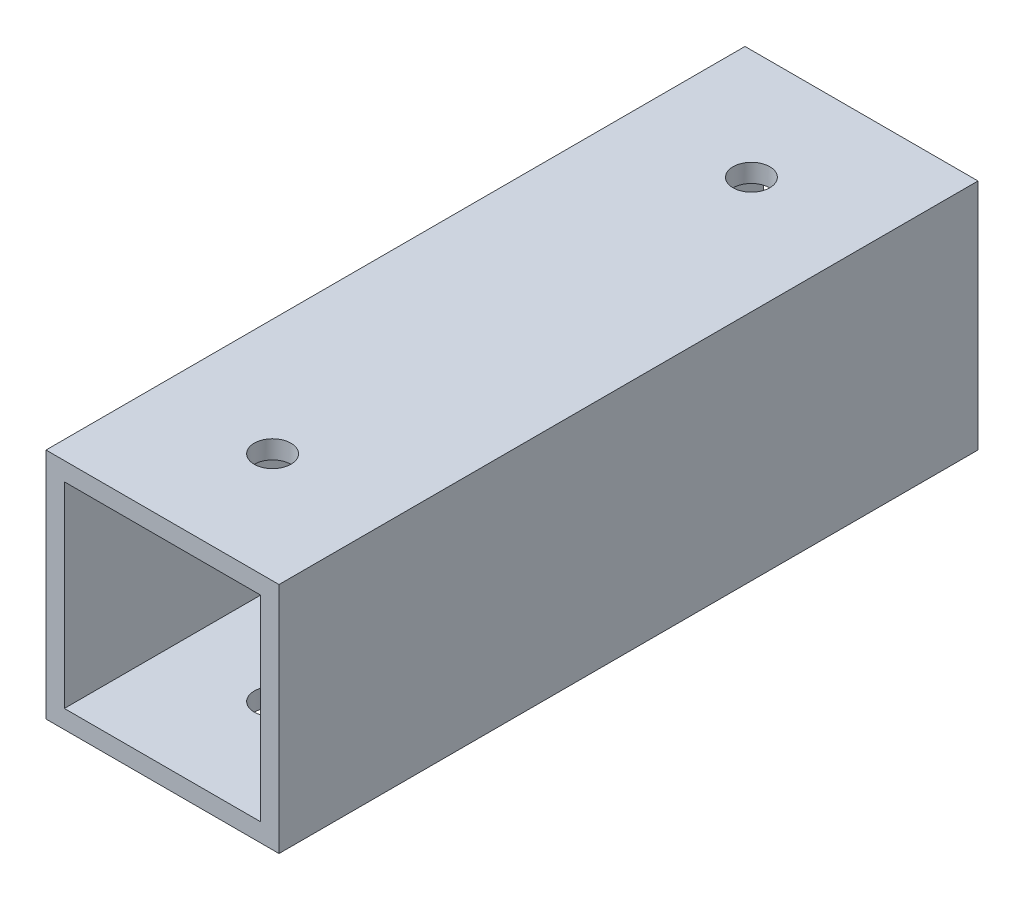
ISO-10303-21;
HEADER;
FILE_DESCRIPTION(('STEP AP214'),'2;1');
FILE_NAME('part.step','',(''),(''),'','','');
FILE_SCHEMA(('AUTOMOTIVE_DESIGN { 1 0 10303 214 1 1 1 1 }'));
ENDSEC;
DATA;
#1=APPLICATION_CONTEXT('core data for automotive mechanical design processes');
#2=APPLICATION_PROTOCOL_DEFINITION('international standard','automotive_design',2000,#1);
#3=PRODUCT_CONTEXT('',#1,'mechanical');
#4=PRODUCT('Part','Part','',(#3));
#5=PRODUCT_RELATED_PRODUCT_CATEGORY('part','',(#4));
#6=PRODUCT_DEFINITION_FORMATION('','',#4);
#7=PRODUCT_DEFINITION_CONTEXT('part definition',#1,'design');
#8=PRODUCT_DEFINITION('design','',#6,#7);
#9=PRODUCT_DEFINITION_SHAPE('','',#8);
#10=(LENGTH_UNIT() NAMED_UNIT(*) SI_UNIT(.MILLI.,.METRE.));
#11=(NAMED_UNIT(*) PLANE_ANGLE_UNIT() SI_UNIT($,.RADIAN.));
#12=(NAMED_UNIT(*) SI_UNIT($,.STERADIAN.) SOLID_ANGLE_UNIT());
#13=UNCERTAINTY_MEASURE_WITH_UNIT(LENGTH_MEASURE(1.E-05),#10,'distance_accuracy_value','');
#14=(GEOMETRIC_REPRESENTATION_CONTEXT(3) GLOBAL_UNCERTAINTY_ASSIGNED_CONTEXT((#13)) GLOBAL_UNIT_ASSIGNED_CONTEXT((#10,
#11,#12)) REPRESENTATION_CONTEXT('',''));
#15=CARTESIAN_POINT('',(0.,0.,0.));
#16=DIRECTION('',(0.,0.,1.));
#17=DIRECTION('',(1.,0.,0.));
#18=AXIS2_PLACEMENT_3D('',#15,#16,#17);
#19=CARTESIAN_POINT('',(0.,0.,76.2));
#20=DIRECTION('',(0.,0.,-1.));
#21=DIRECTION('',(-1.,0.,0.));
#22=AXIS2_PLACEMENT_3D('',#19,#20,#21);
#23=PLANE('',#22);
#24=DIRECTION('',(0.,-1.,0.));
#25=VECTOR('',#24,1.);
#26=CARTESIAN_POINT('',(0.,0.,76.2));
#27=LINE('',#26,#25);
#28=CARTESIAN_POINT('',(0.,25.4,76.2));
#29=VERTEX_POINT('',#28);
#30=CARTESIAN_POINT('',(0.,0.,76.2));
#31=VERTEX_POINT('',#30);
#32=EDGE_CURVE('E137',#29,#31,#27,.T.);
#33=ORIENTED_EDGE('',*,*,#32,.T.);
#34=DIRECTION('',(1.,0.,0.));
#35=VECTOR('',#34,1.);
#36=CARTESIAN_POINT('',(0.,0.,76.2));
#37=LINE('',#36,#35);
#38=CARTESIAN_POINT('',(25.4,0.,76.2));
#39=VERTEX_POINT('',#38);
#40=EDGE_CURVE('E140',#31,#39,#37,.T.);
#41=ORIENTED_EDGE('',*,*,#40,.T.);
#42=DIRECTION('',(0.,1.,0.));
#43=VECTOR('',#42,1.);
#44=CARTESIAN_POINT('',(25.4,0.,76.2));
#45=LINE('',#44,#43);
#46=CARTESIAN_POINT('',(25.4,25.4,76.2));
#47=VERTEX_POINT('',#46);
#48=EDGE_CURVE('E143',#39,#47,#45,.T.);
#49=ORIENTED_EDGE('',*,*,#48,.T.);
#50=DIRECTION('',(-1.,0.,0.));
#51=VECTOR('',#50,1.);
#52=CARTESIAN_POINT('',(0.,25.4,76.2));
#53=LINE('',#52,#51);
#54=EDGE_CURVE('E145',#47,#29,#53,.T.);
#55=ORIENTED_EDGE('',*,*,#54,.T.);
#56=EDGE_LOOP('',(#33,#41,#49,#55));
#57=FACE_BOUND('',#56,.T.);
#58=DIRECTION('',(0.,-1.,0.));
#59=VECTOR('',#58,1.);
#60=CARTESIAN_POINT('',(2.,23.4,76.2));
#61=LINE('',#60,#59);
#62=CARTESIAN_POINT('',(2.,23.4,76.2));
#63=VERTEX_POINT('',#62);
#64=CARTESIAN_POINT('',(2.,2.,76.2));
#65=VERTEX_POINT('',#64);
#66=EDGE_CURVE('E99',#63,#65,#61,.T.);
#67=ORIENTED_EDGE('',*,*,#66,.F.);
#68=DIRECTION('',(-1.,0.,0.));
#69=VECTOR('',#68,1.);
#70=CARTESIAN_POINT('',(2.,23.4,76.2));
#71=LINE('',#70,#69);
#72=CARTESIAN_POINT('',(23.4,23.4,76.2));
#73=VERTEX_POINT('',#72);
#74=EDGE_CURVE('E121',#73,#63,#71,.T.);
#75=ORIENTED_EDGE('',*,*,#74,.F.);
#76=DIRECTION('',(0.,1.,0.));
#77=VECTOR('',#76,1.);
#78=CARTESIAN_POINT('',(23.4,23.4,76.2));
#79=LINE('',#78,#77);
#80=CARTESIAN_POINT('',(23.4,2.,76.2));
#81=VERTEX_POINT('',#80);
#82=EDGE_CURVE('E119',#81,#73,#79,.T.);
#83=ORIENTED_EDGE('',*,*,#82,.F.);
#84=DIRECTION('',(1.,0.,0.));
#85=VECTOR('',#84,1.);
#86=CARTESIAN_POINT('',(2.,2.,76.2));
#87=LINE('',#86,#85);
#88=EDGE_CURVE('E107',#65,#81,#87,.T.);
#89=ORIENTED_EDGE('',*,*,#88,.F.);
#90=EDGE_LOOP('',(#67,#75,#83,#89));
#91=FACE_BOUND('',#90,.T.);
#92=ADVANCED_FACE('F32',(#57,#91),#23,.F.);
#93=CARTESIAN_POINT('',(0.,0.,0.));
#94=DIRECTION('',(0.,0.,-1.));
#95=DIRECTION('',(-1.,0.,0.));
#96=AXIS2_PLACEMENT_3D('',#93,#94,#95);
#97=PLANE('',#96);
#98=DIRECTION('',(0.,-1.,0.));
#99=VECTOR('',#98,1.);
#100=CARTESIAN_POINT('',(0.,0.,0.));
#101=LINE('',#100,#99);
#102=CARTESIAN_POINT('',(0.,25.4,0.));
#103=VERTEX_POINT('',#102);
#104=CARTESIAN_POINT('',(0.,0.,0.));
#105=VERTEX_POINT('',#104);
#106=EDGE_CURVE('E115',#103,#105,#101,.T.);
#107=ORIENTED_EDGE('',*,*,#106,.F.);
#108=DIRECTION('',(-1.,0.,0.));
#109=VECTOR('',#108,1.);
#110=CARTESIAN_POINT('',(0.,25.4,0.));
#111=LINE('',#110,#109);
#112=CARTESIAN_POINT('',(25.4,25.4,0.));
#113=VERTEX_POINT('',#112);
#114=EDGE_CURVE('E141',#113,#103,#111,.T.);
#115=ORIENTED_EDGE('',*,*,#114,.F.);
#116=DIRECTION('',(0.,1.,0.));
#117=VECTOR('',#116,1.);
#118=CARTESIAN_POINT('',(25.4,0.,0.));
#119=LINE('',#118,#117);
#120=CARTESIAN_POINT('',(25.4,0.,0.));
#121=VERTEX_POINT('',#120);
#122=EDGE_CURVE('E152',#121,#113,#119,.T.);
#123=ORIENTED_EDGE('',*,*,#122,.F.);
#124=DIRECTION('',(1.,0.,0.));
#125=VECTOR('',#124,1.);
#126=CARTESIAN_POINT('',(0.,0.,0.));
#127=LINE('',#126,#125);
#128=EDGE_CURVE('E150',#105,#121,#127,.T.);
#129=ORIENTED_EDGE('',*,*,#128,.F.);
#130=EDGE_LOOP('',(#107,#115,#123,#129));
#131=FACE_BOUND('',#130,.T.);
#132=DIRECTION('',(-1.,0.,0.));
#133=VECTOR('',#132,1.);
#134=CARTESIAN_POINT('',(2.,23.4,0.));
#135=LINE('',#134,#133);
#136=CARTESIAN_POINT('',(23.4,23.4,0.));
#137=VERTEX_POINT('',#136);
#138=CARTESIAN_POINT('',(2.,23.4,0.));
#139=VERTEX_POINT('',#138);
#140=EDGE_CURVE('E108',#137,#139,#135,.T.);
#141=ORIENTED_EDGE('',*,*,#140,.T.);
#142=DIRECTION('',(0.,-1.,0.));
#143=VECTOR('',#142,1.);
#144=CARTESIAN_POINT('',(2.,23.4,0.));
#145=LINE('',#144,#143);
#146=CARTESIAN_POINT('',(2.,2.,0.));
#147=VERTEX_POINT('',#146);
#148=EDGE_CURVE('E57',#139,#147,#145,.T.);
#149=ORIENTED_EDGE('',*,*,#148,.T.);
#150=DIRECTION('',(1.,0.,0.));
#151=VECTOR('',#150,1.);
#152=CARTESIAN_POINT('',(2.,2.,0.));
#153=LINE('',#152,#151);
#154=CARTESIAN_POINT('',(23.4,2.,0.));
#155=VERTEX_POINT('',#154);
#156=EDGE_CURVE('E114',#147,#155,#153,.T.);
#157=ORIENTED_EDGE('',*,*,#156,.T.);
#158=DIRECTION('',(0.,1.,0.));
#159=VECTOR('',#158,1.);
#160=CARTESIAN_POINT('',(23.4,23.4,0.));
#161=LINE('',#160,#159);
#162=EDGE_CURVE('E129',#155,#137,#161,.T.);
#163=ORIENTED_EDGE('',*,*,#162,.T.);
#164=EDGE_LOOP('',(#141,#149,#157,#163));
#165=FACE_BOUND('',#164,.T.);
#166=ADVANCED_FACE('F199',(#131,#165),#97,.T.);
#167=CARTESIAN_POINT('',(0.,0.,76.2));
#168=DIRECTION('',(1.,0.,0.));
#169=DIRECTION('',(0.,0.,-1.));
#170=AXIS2_PLACEMENT_3D('',#167,#168,#169);
#171=PLANE('',#170);
#172=ORIENTED_EDGE('',*,*,#106,.T.);
#173=DIRECTION('',(0.,0.,-1.));
#174=VECTOR('',#173,1.);
#175=CARTESIAN_POINT('',(0.,0.,76.2));
#176=LINE('',#175,#174);
#177=EDGE_CURVE('E11',#31,#105,#176,.T.);
#178=ORIENTED_EDGE('',*,*,#177,.F.);
#179=ORIENTED_EDGE('',*,*,#32,.F.);
#180=DIRECTION('',(0.,0.,-1.));
#181=VECTOR('',#180,1.);
#182=CARTESIAN_POINT('',(0.,25.4,76.2));
#183=LINE('',#182,#181);
#184=EDGE_CURVE('E147',#29,#103,#183,.T.);
#185=ORIENTED_EDGE('',*,*,#184,.T.);
#186=EDGE_LOOP('',(#172,#178,#179,#185));
#187=FACE_BOUND('',#186,.T.);
#188=ADVANCED_FACE('F34',(#187),#171,.F.);
#189=CARTESIAN_POINT('',(0.,0.,76.2));
#190=DIRECTION('',(0.,1.,0.));
#191=DIRECTION('',(0.,0.,1.));
#192=AXIS2_PLACEMENT_3D('',#189,#190,#191);
#193=PLANE('',#192);
#194=CARTESIAN_POINT('',(12.7,0.,12.));
#195=DIRECTION('',(0.,1.,0.));
#196=DIRECTION('',(0.,0.,1.));
#197=AXIS2_PLACEMENT_3D('',#194,#195,#196);
#198=CIRCLE('',#197,2.);
#199=CARTESIAN_POINT('',(12.7,0.,14.));
#200=VERTEX_POINT('',#199);
#201=EDGE_CURVE('E164',#200,#200,#198,.T.);
#202=ORIENTED_EDGE('',*,*,#201,.T.);
#203=EDGE_LOOP('',(#202));
#204=FACE_BOUND('',#203,.T.);
#205=CARTESIAN_POINT('',(12.7,0.,64.2));
#206=DIRECTION('',(0.,1.,0.));
#207=DIRECTION('',(0.,0.,1.));
#208=AXIS2_PLACEMENT_3D('',#205,#206,#207);
#209=CIRCLE('',#208,2.);
#210=CARTESIAN_POINT('',(12.7,0.,66.2));
#211=VERTEX_POINT('',#210);
#212=EDGE_CURVE('E175',#211,#211,#209,.T.);
#213=ORIENTED_EDGE('',*,*,#212,.T.);
#214=EDGE_LOOP('',(#213));
#215=FACE_BOUND('',#214,.T.);
#216=ORIENTED_EDGE('',*,*,#128,.T.);
#217=DIRECTION('',(0.,0.,-1.));
#218=VECTOR('',#217,1.);
#219=CARTESIAN_POINT('',(25.4,0.,76.2));
#220=LINE('',#219,#218);
#221=EDGE_CURVE('E41',#39,#121,#220,.T.);
#222=ORIENTED_EDGE('',*,*,#221,.F.);
#223=ORIENTED_EDGE('',*,*,#40,.F.);
#224=ORIENTED_EDGE('',*,*,#177,.T.);
#225=EDGE_LOOP('',(#216,#222,#223,#224));
#226=FACE_BOUND('',#225,.T.);
#227=ADVANCED_FACE('F224',(#204,#215,#226),#193,.F.);
#228=CARTESIAN_POINT('',(25.4,0.,76.2));
#229=DIRECTION('',(-1.,0.,0.));
#230=DIRECTION('',(0.,0.,1.));
#231=AXIS2_PLACEMENT_3D('',#228,#229,#230);
#232=PLANE('',#231);
#233=ORIENTED_EDGE('',*,*,#122,.T.);
#234=DIRECTION('',(0.,0.,-1.));
#235=VECTOR('',#234,1.);
#236=CARTESIAN_POINT('',(25.4,25.4,76.2));
#237=LINE('',#236,#235);
#238=EDGE_CURVE('E157',#47,#113,#237,.T.);
#239=ORIENTED_EDGE('',*,*,#238,.F.);
#240=ORIENTED_EDGE('',*,*,#48,.F.);
#241=ORIENTED_EDGE('',*,*,#221,.T.);
#242=EDGE_LOOP('',(#233,#239,#240,#241));
#243=FACE_BOUND('',#242,.T.);
#244=ADVANCED_FACE('F221',(#243),#232,.F.);
#245=CARTESIAN_POINT('',(0.,25.4,76.2));
#246=DIRECTION('',(0.,-1.,0.));
#247=DIRECTION('',(0.,0.,-1.));
#248=AXIS2_PLACEMENT_3D('',#245,#246,#247);
#249=PLANE('',#248);
#250=CARTESIAN_POINT('',(12.7,25.4,12.));
#251=DIRECTION('',(0.,1.,0.));
#252=DIRECTION('',(0.,0.,1.));
#253=AXIS2_PLACEMENT_3D('',#250,#251,#252);
#254=CIRCLE('',#253,2.);
#255=CARTESIAN_POINT('',(12.7,25.4,14.));
#256=VERTEX_POINT('',#255);
#257=EDGE_CURVE('E170',#256,#256,#254,.T.);
#258=ORIENTED_EDGE('',*,*,#257,.F.);
#259=EDGE_LOOP('',(#258));
#260=FACE_BOUND('',#259,.T.);
#261=CARTESIAN_POINT('',(12.7,25.4,64.2));
#262=DIRECTION('',(0.,1.,0.));
#263=DIRECTION('',(0.,0.,1.));
#264=AXIS2_PLACEMENT_3D('',#261,#262,#263);
#265=CIRCLE('',#264,2.);
#266=CARTESIAN_POINT('',(12.7,25.4,66.2));
#267=VERTEX_POINT('',#266);
#268=EDGE_CURVE('E180',#267,#267,#265,.T.);
#269=ORIENTED_EDGE('',*,*,#268,.F.);
#270=EDGE_LOOP('',(#269));
#271=FACE_BOUND('',#270,.T.);
#272=ORIENTED_EDGE('',*,*,#114,.T.);
#273=ORIENTED_EDGE('',*,*,#184,.F.);
#274=ORIENTED_EDGE('',*,*,#54,.F.);
#275=ORIENTED_EDGE('',*,*,#238,.T.);
#276=EDGE_LOOP('',(#272,#273,#274,#275));
#277=FACE_BOUND('',#276,.T.);
#278=ADVANCED_FACE('F218',(#260,#271,#277),#249,.F.);
#279=CARTESIAN_POINT('',(2.,23.4,76.2));
#280=DIRECTION('',(1.,0.,0.));
#281=DIRECTION('',(0.,1.,0.));
#282=AXIS2_PLACEMENT_3D('',#279,#280,#281);
#283=PLANE('',#282);
#284=ORIENTED_EDGE('',*,*,#148,.F.);
#285=DIRECTION('',(0.,0.,-1.));
#286=VECTOR('',#285,1.);
#287=CARTESIAN_POINT('',(2.,23.4,76.2));
#288=LINE('',#287,#286);
#289=EDGE_CURVE('E103',#63,#139,#288,.T.);
#290=ORIENTED_EDGE('',*,*,#289,.F.);
#291=ORIENTED_EDGE('',*,*,#66,.T.);
#292=DIRECTION('',(0.,0.,-1.));
#293=VECTOR('',#292,1.);
#294=CARTESIAN_POINT('',(2.,2.,76.2));
#295=LINE('',#294,#293);
#296=EDGE_CURVE('E102',#65,#147,#295,.T.);
#297=ORIENTED_EDGE('',*,*,#296,.T.);
#298=EDGE_LOOP('',(#284,#290,#291,#297));
#299=FACE_BOUND('',#298,.T.);
#300=ADVANCED_FACE('F101',(#299),#283,.T.);
#301=CARTESIAN_POINT('',(2.,2.,76.2));
#302=DIRECTION('',(0.,1.,0.));
#303=DIRECTION('',(0.,0.,1.));
#304=AXIS2_PLACEMENT_3D('',#301,#302,#303);
#305=PLANE('',#304);
#306=CARTESIAN_POINT('',(12.7,2.,12.));
#307=DIRECTION('',(0.,1.,0.));
#308=DIRECTION('',(0.,0.,1.));
#309=AXIS2_PLACEMENT_3D('',#306,#307,#308);
#310=CIRCLE('',#309,2.);
#311=CARTESIAN_POINT('',(12.7,2.,14.));
#312=VERTEX_POINT('',#311);
#313=EDGE_CURVE('E127',#312,#312,#310,.T.);
#314=ORIENTED_EDGE('',*,*,#313,.F.);
#315=EDGE_LOOP('',(#314));
#316=FACE_BOUND('',#315,.T.);
#317=CARTESIAN_POINT('',(12.7,2.,64.2));
#318=DIRECTION('',(0.,1.,0.));
#319=DIRECTION('',(0.,0.,1.));
#320=AXIS2_PLACEMENT_3D('',#317,#318,#319);
#321=CIRCLE('',#320,2.);
#322=CARTESIAN_POINT('',(12.7,2.,66.2));
#323=VERTEX_POINT('',#322);
#324=EDGE_CURVE('E163',#323,#323,#321,.T.);
#325=ORIENTED_EDGE('',*,*,#324,.F.);
#326=EDGE_LOOP('',(#325));
#327=FACE_BOUND('',#326,.T.);
#328=ORIENTED_EDGE('',*,*,#156,.F.);
#329=ORIENTED_EDGE('',*,*,#296,.F.);
#330=ORIENTED_EDGE('',*,*,#88,.T.);
#331=DIRECTION('',(0.,0.,-1.));
#332=VECTOR('',#331,1.);
#333=CARTESIAN_POINT('',(23.4,2.,76.2));
#334=LINE('',#333,#332);
#335=EDGE_CURVE('E116',#81,#155,#334,.T.);
#336=ORIENTED_EDGE('',*,*,#335,.T.);
#337=EDGE_LOOP('',(#328,#329,#330,#336));
#338=FACE_BOUND('',#337,.T.);
#339=ADVANCED_FACE('F111',(#316,#327,#338),#305,.T.);
#340=CARTESIAN_POINT('',(23.4,23.4,76.2));
#341=DIRECTION('',(-1.,0.,0.));
#342=DIRECTION('',(0.,-1.,0.));
#343=AXIS2_PLACEMENT_3D('',#340,#341,#342);
#344=PLANE('',#343);
#345=ORIENTED_EDGE('',*,*,#162,.F.);
#346=ORIENTED_EDGE('',*,*,#335,.F.);
#347=ORIENTED_EDGE('',*,*,#82,.T.);
#348=DIRECTION('',(0.,0.,-1.));
#349=VECTOR('',#348,1.);
#350=CARTESIAN_POINT('',(23.4,23.4,76.2));
#351=LINE('',#350,#349);
#352=EDGE_CURVE('E49',#73,#137,#351,.T.);
#353=ORIENTED_EDGE('',*,*,#352,.T.);
#354=EDGE_LOOP('',(#345,#346,#347,#353));
#355=FACE_BOUND('',#354,.T.);
#356=ADVANCED_FACE('F195',(#355),#344,.T.);
#357=CARTESIAN_POINT('',(2.,23.4,76.2));
#358=DIRECTION('',(0.,-1.,0.));
#359=DIRECTION('',(0.,0.,-1.));
#360=AXIS2_PLACEMENT_3D('',#357,#358,#359);
#361=PLANE('',#360);
#362=CARTESIAN_POINT('',(12.7,23.4,12.));
#363=DIRECTION('',(0.,-1.,0.));
#364=DIRECTION('',(0.,0.,-1.));
#365=AXIS2_PLACEMENT_3D('',#362,#363,#364);
#366=CIRCLE('',#365,2.);
#367=CARTESIAN_POINT('',(12.7,23.4,10.));
#368=VERTEX_POINT('',#367);
#369=EDGE_CURVE('E36',#368,#368,#366,.T.);
#370=ORIENTED_EDGE('',*,*,#369,.F.);
#371=EDGE_LOOP('',(#370));
#372=FACE_BOUND('',#371,.T.);
#373=CARTESIAN_POINT('',(12.7,23.4,64.2));
#374=DIRECTION('',(0.,-1.,0.));
#375=DIRECTION('',(0.,0.,-1.));
#376=AXIS2_PLACEMENT_3D('',#373,#374,#375);
#377=CIRCLE('',#376,2.);
#378=CARTESIAN_POINT('',(12.7,23.4,62.2));
#379=VERTEX_POINT('',#378);
#380=EDGE_CURVE('E161',#379,#379,#377,.T.);
#381=ORIENTED_EDGE('',*,*,#380,.F.);
#382=EDGE_LOOP('',(#381));
#383=FACE_BOUND('',#382,.T.);
#384=ORIENTED_EDGE('',*,*,#140,.F.);
#385=ORIENTED_EDGE('',*,*,#352,.F.);
#386=ORIENTED_EDGE('',*,*,#74,.T.);
#387=ORIENTED_EDGE('',*,*,#289,.T.);
#388=EDGE_LOOP('',(#384,#385,#386,#387));
#389=FACE_BOUND('',#388,.T.);
#390=ADVANCED_FACE('F191',(#372,#383,#389),#361,.T.);
#391=CARTESIAN_POINT('',(12.7,0.,64.2));
#392=DIRECTION('',(0.,1.,0.));
#393=DIRECTION('',(0.,0.,1.));
#394=AXIS2_PLACEMENT_3D('',#391,#392,#393);
#395=CYLINDRICAL_SURFACE('',#394,2.);
#396=ORIENTED_EDGE('',*,*,#380,.T.);
#397=EDGE_LOOP('',(#396));
#398=FACE_BOUND('',#397,.T.);
#399=ORIENTED_EDGE('',*,*,#268,.T.);
#400=EDGE_LOOP('',(#399));
#401=FACE_BOUND('',#400,.T.);
#402=ADVANCED_FACE('F194',(#398,#401),#395,.F.);
#403=CARTESIAN_POINT('',(12.7,0.,12.));
#404=DIRECTION('',(0.,1.,0.));
#405=DIRECTION('',(0.,0.,1.));
#406=AXIS2_PLACEMENT_3D('',#403,#404,#405);
#407=CYLINDRICAL_SURFACE('',#406,2.);
#408=ORIENTED_EDGE('',*,*,#369,.T.);
#409=EDGE_LOOP('',(#408));
#410=FACE_BOUND('',#409,.T.);
#411=ORIENTED_EDGE('',*,*,#257,.T.);
#412=EDGE_LOOP('',(#411));
#413=FACE_BOUND('',#412,.T.);
#414=ADVANCED_FACE('F188',(#410,#413),#407,.F.);
#415=ORIENTED_EDGE('',*,*,#324,.T.);
#416=EDGE_LOOP('',(#415));
#417=FACE_BOUND('',#416,.T.);
#418=ORIENTED_EDGE('',*,*,#212,.F.);
#419=EDGE_LOOP('',(#418));
#420=FACE_BOUND('',#419,.T.);
#421=ADVANCED_FACE('F246',(#417,#420),#395,.F.);
#422=ORIENTED_EDGE('',*,*,#313,.T.);
#423=EDGE_LOOP('',(#422));
#424=FACE_BOUND('',#423,.T.);
#425=ORIENTED_EDGE('',*,*,#201,.F.);
#426=EDGE_LOOP('',(#425));
#427=FACE_BOUND('',#426,.T.);
#428=ADVANCED_FACE('F248',(#424,#427),#407,.F.);
#429=CLOSED_SHELL('',(#92,#166,#188,#227,#244,#278,#300,#339,#356,#390,#402,#414,#421,#428));
#430=MANIFOLD_SOLID_BREP('B2',#429);
#431=ADVANCED_BREP_SHAPE_REPRESENTATION('',(#18,#430),#14);
#432=SHAPE_DEFINITION_REPRESENTATION(#9,#431);
ENDSEC;
END-ISO-10303-21;
